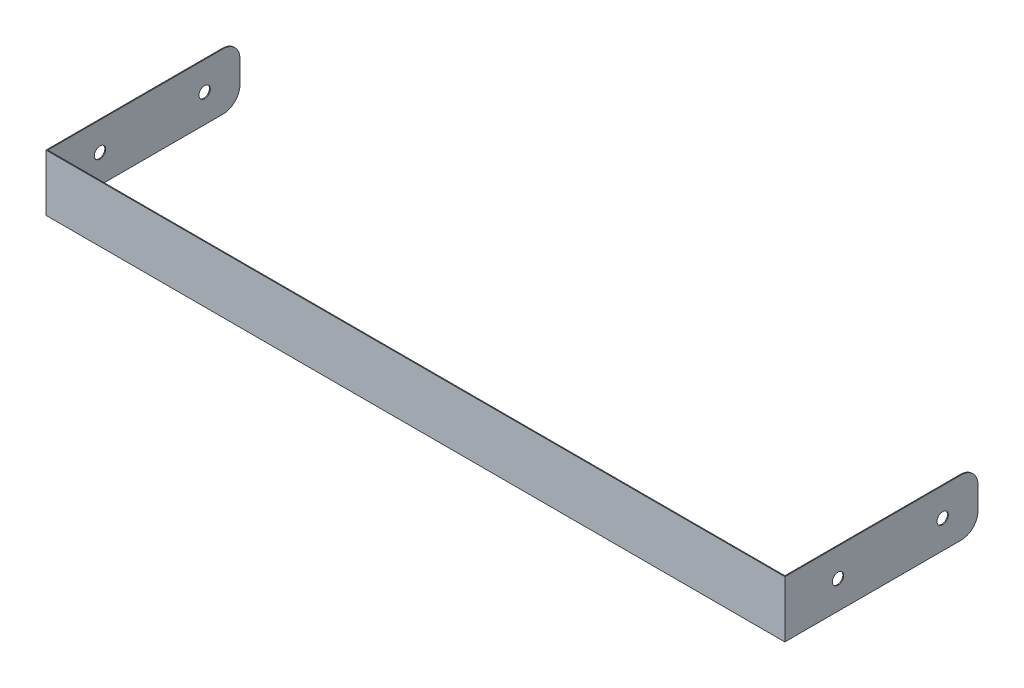
ISO-10303-21;
HEADER;
FILE_DESCRIPTION(('STEP AP214'),'2;1');
FILE_NAME('part.step','',(''),(''),'','','');
FILE_SCHEMA(('AUTOMOTIVE_DESIGN { 1 0 10303 214 1 1 1 1 }'));
ENDSEC;
DATA;
#1=APPLICATION_CONTEXT('core data for automotive mechanical design processes');
#2=APPLICATION_PROTOCOL_DEFINITION('international standard','automotive_design',2000,#1);
#3=PRODUCT_CONTEXT('',#1,'mechanical');
#4=PRODUCT('Part','Part','',(#3));
#5=PRODUCT_RELATED_PRODUCT_CATEGORY('part','',(#4));
#6=PRODUCT_DEFINITION_FORMATION('','',#4);
#7=PRODUCT_DEFINITION_CONTEXT('part definition',#1,'design');
#8=PRODUCT_DEFINITION('design','',#6,#7);
#9=PRODUCT_DEFINITION_SHAPE('','',#8);
#10=(LENGTH_UNIT() NAMED_UNIT(*) SI_UNIT(.MILLI.,.METRE.));
#11=(NAMED_UNIT(*) PLANE_ANGLE_UNIT() SI_UNIT($,.RADIAN.));
#12=(NAMED_UNIT(*) SI_UNIT($,.STERADIAN.) SOLID_ANGLE_UNIT());
#13=UNCERTAINTY_MEASURE_WITH_UNIT(LENGTH_MEASURE(1.E-05),#10,'distance_accuracy_value','');
#14=(GEOMETRIC_REPRESENTATION_CONTEXT(3) GLOBAL_UNCERTAINTY_ASSIGNED_CONTEXT((#13)) GLOBAL_UNIT_ASSIGNED_CONTEXT((#10,
#11,#12)) REPRESENTATION_CONTEXT('',''));
#15=CARTESIAN_POINT('',(0.,0.,0.));
#16=DIRECTION('',(0.,0.,1.));
#17=DIRECTION('',(1.,0.,0.));
#18=AXIS2_PLACEMENT_3D('',#15,#16,#17);
#19=CARTESIAN_POINT('',(-130.5,10.,0.));
#20=DIRECTION('',(1.,0.,0.));
#21=DIRECTION('',(0.,0.,-1.));
#22=AXIS2_PLACEMENT_3D('',#19,#20,#21);
#23=PLANE('',#22);
#24=CARTESIAN_POINT('',(-130.5,5.,6.25000000000002));
#25=DIRECTION('',(1.,0.,0.));
#26=DIRECTION('',(0.,0.,-1.));
#27=AXIS2_PLACEMENT_3D('',#24,#25,#26);
#28=CIRCLE('',#27,1.);
#29=CARTESIAN_POINT('',(-130.5,5.,5.25000000000002));
#30=VERTEX_POINT('',#29);
#31=EDGE_CURVE('E162',#30,#30,#28,.T.);
#32=ORIENTED_EDGE('',*,*,#31,.F.);
#33=EDGE_LOOP('',(#32));
#34=FACE_BOUND('',#33,.T.);
#35=CARTESIAN_POINT('',(-130.5,5.,24.75));
#36=DIRECTION('',(1.,0.,0.));
#37=DIRECTION('',(0.,0.,-1.));
#38=AXIS2_PLACEMENT_3D('',#35,#36,#37);
#39=CIRCLE('',#38,1.);
#40=CARTESIAN_POINT('',(-130.5,5.,23.75));
#41=VERTEX_POINT('',#40);
#42=EDGE_CURVE('E223',#41,#41,#39,.T.);
#43=ORIENTED_EDGE('',*,*,#42,.F.);
#44=EDGE_LOOP('',(#43));
#45=FACE_BOUND('',#44,.T.);
#46=DIRECTION('',(0.,0.,1.));
#47=VECTOR('',#46,1.);
#48=CARTESIAN_POINT('',(-130.5,0.,0.));
#49=LINE('',#48,#47);
#50=CARTESIAN_POINT('',(-130.5,0.,3.));
#51=VERTEX_POINT('',#50);
#52=CARTESIAN_POINT('',(-130.5,0.,34.));
#53=VERTEX_POINT('',#52);
#54=EDGE_CURVE('E160',#51,#53,#49,.T.);
#55=ORIENTED_EDGE('',*,*,#54,.F.);
#56=CARTESIAN_POINT('',(-130.5,3.,3.));
#57=DIRECTION('',(1.,0.,0.));
#58=DIRECTION('',(0.,0.,-1.));
#59=AXIS2_PLACEMENT_3D('',#56,#57,#58);
#60=CIRCLE('',#59,3.);
#61=CARTESIAN_POINT('',(-130.5,3.,0.));
#62=VERTEX_POINT('',#61);
#63=EDGE_CURVE('E11',#51,#62,#60,.T.);
#64=ORIENTED_EDGE('',*,*,#63,.T.);
#65=DIRECTION('',(0.,-1.,0.));
#66=VECTOR('',#65,1.);
#67=CARTESIAN_POINT('',(-130.5,10.,0.));
#68=LINE('',#67,#66);
#69=CARTESIAN_POINT('',(-130.5,7.,0.));
#70=VERTEX_POINT('',#69);
#71=EDGE_CURVE('E174',#70,#62,#68,.T.);
#72=ORIENTED_EDGE('',*,*,#71,.F.);
#73=CARTESIAN_POINT('',(-130.5,7.,3.));
#74=DIRECTION('',(1.,0.,0.));
#75=DIRECTION('',(0.,0.,-1.));
#76=AXIS2_PLACEMENT_3D('',#73,#74,#75);
#77=CIRCLE('',#76,3.);
#78=CARTESIAN_POINT('',(-130.5,10.,3.));
#79=VERTEX_POINT('',#78);
#80=EDGE_CURVE('E43',#70,#79,#77,.T.);
#81=ORIENTED_EDGE('',*,*,#80,.T.);
#82=DIRECTION('',(0.,0.,1.));
#83=VECTOR('',#82,1.);
#84=CARTESIAN_POINT('',(-130.5,10.,0.));
#85=LINE('',#84,#83);
#86=CARTESIAN_POINT('',(-130.5,10.,34.));
#87=VERTEX_POINT('',#86);
#88=EDGE_CURVE('E124',#79,#87,#85,.T.);
#89=ORIENTED_EDGE('',*,*,#88,.T.);
#90=DIRECTION('',(0.,-1.,0.));
#91=VECTOR('',#90,1.);
#92=CARTESIAN_POINT('',(-130.5,10.,34.));
#93=LINE('',#92,#91);
#94=EDGE_CURVE('E126',#87,#53,#93,.T.);
#95=ORIENTED_EDGE('',*,*,#94,.T.);
#96=EDGE_LOOP('',(#55,#64,#72,#81,#89,#95));
#97=FACE_BOUND('',#96,.T.);
#98=ADVANCED_FACE('F34',(#34,#45,#97),#23,.T.);
#99=CARTESIAN_POINT('',(-130.5,10.,0.));
#100=DIRECTION('',(1.06666736205726E-13,0.,1.));
#101=DIRECTION('',(1.,0.,-1.06666736205726E-13));
#102=AXIS2_PLACEMENT_3D('',#99,#100,#101);
#103=PLANE('',#102);
#104=ORIENTED_EDGE('',*,*,#71,.T.);
#105=DIRECTION('',(-1.,0.,1.06666736205726E-13));
#106=VECTOR('',#105,1.);
#107=CARTESIAN_POINT('',(-130.5,3.,0.));
#108=LINE('',#107,#106);
#109=CARTESIAN_POINT('',(-130.65,3.,0.));
#110=VERTEX_POINT('',#109);
#111=EDGE_CURVE('E214',#62,#110,#108,.T.);
#112=ORIENTED_EDGE('',*,*,#111,.T.);
#113=DIRECTION('',(0.,-1.,0.));
#114=VECTOR('',#113,1.);
#115=CARTESIAN_POINT('',(-130.65,10.,0.));
#116=LINE('',#115,#114);
#117=CARTESIAN_POINT('',(-130.65,7.,0.));
#118=VERTEX_POINT('',#117);
#119=EDGE_CURVE('E177',#118,#110,#116,.T.);
#120=ORIENTED_EDGE('',*,*,#119,.F.);
#121=DIRECTION('',(-1.,0.,1.06666736205726E-13));
#122=VECTOR('',#121,1.);
#123=CARTESIAN_POINT('',(-130.5,7.,0.));
#124=LINE('',#123,#122);
#125=EDGE_CURVE('E56',#118,#70,#124,.F.);
#126=ORIENTED_EDGE('',*,*,#125,.T.);
#127=EDGE_LOOP('',(#104,#112,#120,#126));
#128=FACE_BOUND('',#127,.T.);
#129=ADVANCED_FACE('F284',(#128),#103,.F.);
#130=CARTESIAN_POINT('',(-130.65,10.,34.15));
#131=DIRECTION('',(-1.,0.,0.));
#132=DIRECTION('',(0.,0.,1.));
#133=AXIS2_PLACEMENT_3D('',#130,#131,#132);
#134=PLANE('',#133);
#135=CARTESIAN_POINT('',(-130.65,5.,6.25000000000002));
#136=DIRECTION('',(-1.,0.,0.));
#137=DIRECTION('',(0.,0.,1.));
#138=AXIS2_PLACEMENT_3D('',#135,#136,#137);
#139=CIRCLE('',#138,1.);
#140=CARTESIAN_POINT('',(-130.65,5.,7.25000000000002));
#141=VERTEX_POINT('',#140);
#142=EDGE_CURVE('E224',#141,#141,#139,.F.);
#143=ORIENTED_EDGE('',*,*,#142,.T.);
#144=EDGE_LOOP('',(#143));
#145=FACE_BOUND('',#144,.T.);
#146=CARTESIAN_POINT('',(-130.65,5.,24.75));
#147=DIRECTION('',(-1.,0.,0.));
#148=DIRECTION('',(0.,0.,1.));
#149=AXIS2_PLACEMENT_3D('',#146,#147,#148);
#150=CIRCLE('',#149,1.);
#151=CARTESIAN_POINT('',(-130.65,5.,25.75));
#152=VERTEX_POINT('',#151);
#153=EDGE_CURVE('E238',#152,#152,#150,.F.);
#154=ORIENTED_EDGE('',*,*,#153,.T.);
#155=EDGE_LOOP('',(#154));
#156=FACE_BOUND('',#155,.T.);
#157=ORIENTED_EDGE('',*,*,#119,.T.);
#158=CARTESIAN_POINT('',(-130.65,3.,3.00000000000002));
#159=DIRECTION('',(-1.,0.,0.));
#160=DIRECTION('',(0.,0.,1.));
#161=AXIS2_PLACEMENT_3D('',#158,#159,#160);
#162=CIRCLE('',#161,3.);
#163=CARTESIAN_POINT('',(-130.65,0.,3.00000000000002));
#164=VERTEX_POINT('',#163);
#165=EDGE_CURVE('E219',#110,#164,#162,.T.);
#166=ORIENTED_EDGE('',*,*,#165,.T.);
#167=DIRECTION('',(0.,0.,-1.));
#168=VECTOR('',#167,1.);
#169=CARTESIAN_POINT('',(-130.65,0.,34.15));
#170=LINE('',#169,#168);
#171=CARTESIAN_POINT('',(-130.65,0.,34.15));
#172=VERTEX_POINT('',#171);
#173=EDGE_CURVE('E134',#172,#164,#170,.T.);
#174=ORIENTED_EDGE('',*,*,#173,.F.);
#175=DIRECTION('',(0.,-1.,0.));
#176=VECTOR('',#175,1.);
#177=CARTESIAN_POINT('',(-130.65,10.,34.15));
#178=LINE('',#177,#176);
#179=CARTESIAN_POINT('',(-130.65,10.,34.15));
#180=VERTEX_POINT('',#179);
#181=EDGE_CURVE('E180',#180,#172,#178,.T.);
#182=ORIENTED_EDGE('',*,*,#181,.F.);
#183=DIRECTION('',(0.,0.,-1.));
#184=VECTOR('',#183,1.);
#185=CARTESIAN_POINT('',(-130.65,10.,34.15));
#186=LINE('',#185,#184);
#187=CARTESIAN_POINT('',(-130.65,10.,3.00000000000002));
#188=VERTEX_POINT('',#187);
#189=EDGE_CURVE('E142',#180,#188,#186,.T.);
#190=ORIENTED_EDGE('',*,*,#189,.T.);
#191=CARTESIAN_POINT('',(-130.65,7.,3.00000000000002));
#192=DIRECTION('',(-1.,0.,0.));
#193=DIRECTION('',(0.,0.,1.));
#194=AXIS2_PLACEMENT_3D('',#191,#192,#193);
#195=CIRCLE('',#194,3.);
#196=EDGE_CURVE('E217',#188,#118,#195,.T.);
#197=ORIENTED_EDGE('',*,*,#196,.T.);
#198=EDGE_LOOP('',(#157,#166,#174,#182,#190,#197));
#199=FACE_BOUND('',#198,.T.);
#200=ADVANCED_FACE('F285',(#145,#156,#199),#134,.T.);
#201=CARTESIAN_POINT('',(0.,10.,34.15));
#202=DIRECTION('',(0.,0.,1.));
#203=DIRECTION('',(1.,0.,0.));
#204=AXIS2_PLACEMENT_3D('',#201,#202,#203);
#205=PLANE('',#204);
#206=DIRECTION('',(-1.,0.,0.));
#207=VECTOR('',#206,1.);
#208=CARTESIAN_POINT('',(0.,0.,34.15));
#209=LINE('',#208,#207);
#210=CARTESIAN_POINT('',(0.,0.,34.15));
#211=VERTEX_POINT('',#210);
#212=EDGE_CURVE('E169',#211,#172,#209,.T.);
#213=ORIENTED_EDGE('',*,*,#212,.F.);
#214=DIRECTION('',(0.,-1.,0.));
#215=VECTOR('',#214,1.);
#216=CARTESIAN_POINT('',(0.,10.,34.15));
#217=LINE('',#216,#215);
#218=CARTESIAN_POINT('',(0.,10.,34.15));
#219=VERTEX_POINT('',#218);
#220=EDGE_CURVE('E182',#219,#211,#217,.T.);
#221=ORIENTED_EDGE('',*,*,#220,.F.);
#222=DIRECTION('',(-1.,0.,0.));
#223=VECTOR('',#222,1.);
#224=CARTESIAN_POINT('',(0.,10.,34.15));
#225=LINE('',#224,#223);
#226=EDGE_CURVE('E155',#219,#180,#225,.T.);
#227=ORIENTED_EDGE('',*,*,#226,.T.);
#228=ORIENTED_EDGE('',*,*,#181,.T.);
#229=EDGE_LOOP('',(#213,#221,#227,#228));
#230=FACE_BOUND('',#229,.T.);
#231=ADVANCED_FACE('F277',(#230),#205,.T.);
#232=CARTESIAN_POINT('',(0.,10.,0.));
#233=DIRECTION('',(1.,0.,0.));
#234=DIRECTION('',(0.,0.,-1.));
#235=AXIS2_PLACEMENT_3D('',#232,#233,#234);
#236=PLANE('',#235);
#237=CARTESIAN_POINT('',(0.,5.,6.25));
#238=DIRECTION('',(1.,0.,0.));
#239=DIRECTION('',(0.,0.,-1.));
#240=AXIS2_PLACEMENT_3D('',#237,#238,#239);
#241=CIRCLE('',#240,1.);
#242=CARTESIAN_POINT('',(0.,5.,5.25));
#243=VERTEX_POINT('',#242);
#244=EDGE_CURVE('E230',#243,#243,#241,.T.);
#245=ORIENTED_EDGE('',*,*,#244,.F.);
#246=EDGE_LOOP('',(#245));
#247=FACE_BOUND('',#246,.T.);
#248=CARTESIAN_POINT('',(0.,5.,24.75));
#249=DIRECTION('',(1.,0.,0.));
#250=DIRECTION('',(0.,0.,-1.));
#251=AXIS2_PLACEMENT_3D('',#248,#249,#250);
#252=CIRCLE('',#251,1.);
#253=CARTESIAN_POINT('',(0.,5.,23.75));
#254=VERTEX_POINT('',#253);
#255=EDGE_CURVE('E235',#254,#254,#252,.T.);
#256=ORIENTED_EDGE('',*,*,#255,.F.);
#257=EDGE_LOOP('',(#256));
#258=FACE_BOUND('',#257,.T.);
#259=DIRECTION('',(0.,0.,1.));
#260=VECTOR('',#259,1.);
#261=CARTESIAN_POINT('',(0.,0.,0.));
#262=LINE('',#261,#260);
#263=CARTESIAN_POINT('',(0.,0.,3.));
#264=VERTEX_POINT('',#263);
#265=EDGE_CURVE('E167',#264,#211,#262,.T.);
#266=ORIENTED_EDGE('',*,*,#265,.F.);
#267=CARTESIAN_POINT('',(0.,3.,3.));
#268=DIRECTION('',(1.,0.,0.));
#269=DIRECTION('',(0.,0.,-1.));
#270=AXIS2_PLACEMENT_3D('',#267,#268,#269);
#271=CIRCLE('',#270,3.);
#272=CARTESIAN_POINT('',(0.,3.,0.));
#273=VERTEX_POINT('',#272);
#274=EDGE_CURVE('E198',#264,#273,#271,.T.);
#275=ORIENTED_EDGE('',*,*,#274,.T.);
#276=DIRECTION('',(0.,-1.,0.));
#277=VECTOR('',#276,1.);
#278=CARTESIAN_POINT('',(0.,10.,0.));
#279=LINE('',#278,#277);
#280=CARTESIAN_POINT('',(0.,7.,0.));
#281=VERTEX_POINT('',#280);
#282=EDGE_CURVE('E185',#281,#273,#279,.T.);
#283=ORIENTED_EDGE('',*,*,#282,.F.);
#284=CARTESIAN_POINT('',(0.,7.,3.));
#285=DIRECTION('',(1.,0.,0.));
#286=DIRECTION('',(0.,0.,-1.));
#287=AXIS2_PLACEMENT_3D('',#284,#285,#286);
#288=CIRCLE('',#287,3.);
#289=CARTESIAN_POINT('',(0.,10.,3.));
#290=VERTEX_POINT('',#289);
#291=EDGE_CURVE('E196',#281,#290,#288,.T.);
#292=ORIENTED_EDGE('',*,*,#291,.T.);
#293=DIRECTION('',(0.,0.,1.));
#294=VECTOR('',#293,1.);
#295=CARTESIAN_POINT('',(0.,10.,0.));
#296=LINE('',#295,#294);
#297=EDGE_CURVE('E150',#290,#219,#296,.T.);
#298=ORIENTED_EDGE('',*,*,#297,.T.);
#299=ORIENTED_EDGE('',*,*,#220,.T.);
#300=EDGE_LOOP('',(#266,#275,#283,#292,#298,#299));
#301=FACE_BOUND('',#300,.T.);
#302=ADVANCED_FACE('F271',(#247,#258,#301),#236,.T.);
#303=CARTESIAN_POINT('',(-0.15,10.,0.));
#304=DIRECTION('',(1.06421806845905E-13,0.,-1.));
#305=DIRECTION('',(-1.,0.,-1.06421806845905E-13));
#306=AXIS2_PLACEMENT_3D('',#303,#304,#305);
#307=PLANE('',#306);
#308=ORIENTED_EDGE('',*,*,#282,.T.);
#309=DIRECTION('',(1.,0.,1.06421806845905E-13));
#310=VECTOR('',#309,1.);
#311=CARTESIAN_POINT('',(-0.15,3.,0.));
#312=LINE('',#311,#310);
#313=CARTESIAN_POINT('',(-0.15,3.,0.));
#314=VERTEX_POINT('',#313);
#315=EDGE_CURVE('E203',#273,#314,#312,.F.);
#316=ORIENTED_EDGE('',*,*,#315,.T.);
#317=DIRECTION('',(0.,-1.,0.));
#318=VECTOR('',#317,1.);
#319=CARTESIAN_POINT('',(-0.15,10.,0.));
#320=LINE('',#319,#318);
#321=CARTESIAN_POINT('',(-0.15,7.,0.));
#322=VERTEX_POINT('',#321);
#323=EDGE_CURVE('E188',#322,#314,#320,.T.);
#324=ORIENTED_EDGE('',*,*,#323,.F.);
#325=DIRECTION('',(1.,0.,1.06421806845905E-13));
#326=VECTOR('',#325,1.);
#327=CARTESIAN_POINT('',(-0.15,7.,0.));
#328=LINE('',#327,#326);
#329=EDGE_CURVE('E200',#322,#281,#328,.T.);
#330=ORIENTED_EDGE('',*,*,#329,.T.);
#331=EDGE_LOOP('',(#308,#316,#324,#330));
#332=FACE_BOUND('',#331,.T.);
#333=ADVANCED_FACE('F254',(#332),#307,.T.);
#334=CARTESIAN_POINT('',(-0.150000000000007,10.,34.));
#335=DIRECTION('',(-1.,0.,0.));
#336=DIRECTION('',(0.,0.,1.));
#337=AXIS2_PLACEMENT_3D('',#334,#335,#336);
#338=PLANE('',#337);
#339=CARTESIAN_POINT('',(-0.150000000000011,5.,6.25));
#340=DIRECTION('',(-1.,0.,0.));
#341=DIRECTION('',(0.,0.,1.));
#342=AXIS2_PLACEMENT_3D('',#339,#340,#341);
#343=CIRCLE('',#342,1.);
#344=CARTESIAN_POINT('',(-0.150000000000011,5.,7.25));
#345=VERTEX_POINT('',#344);
#346=EDGE_CURVE('E38',#345,#345,#343,.T.);
#347=ORIENTED_EDGE('',*,*,#346,.F.);
#348=EDGE_LOOP('',(#347));
#349=FACE_BOUND('',#348,.T.);
#350=CARTESIAN_POINT('',(-0.150000000000011,5.,24.75));
#351=DIRECTION('',(-1.,0.,0.));
#352=DIRECTION('',(0.,0.,1.));
#353=AXIS2_PLACEMENT_3D('',#350,#351,#352);
#354=CIRCLE('',#353,1.);
#355=CARTESIAN_POINT('',(-0.150000000000011,5.,25.75));
#356=VERTEX_POINT('',#355);
#357=EDGE_CURVE('E221',#356,#356,#354,.T.);
#358=ORIENTED_EDGE('',*,*,#357,.F.);
#359=EDGE_LOOP('',(#358));
#360=FACE_BOUND('',#359,.T.);
#361=ORIENTED_EDGE('',*,*,#323,.T.);
#362=CARTESIAN_POINT('',(-0.150000000000001,3.,2.99999999999998));
#363=DIRECTION('',(-1.,0.,0.));
#364=DIRECTION('',(0.,0.,1.));
#365=AXIS2_PLACEMENT_3D('',#362,#363,#364);
#366=CIRCLE('',#365,3.);
#367=CARTESIAN_POINT('',(-0.150000000000001,0.,2.99999999999999));
#368=VERTEX_POINT('',#367);
#369=EDGE_CURVE('E207',#314,#368,#366,.T.);
#370=ORIENTED_EDGE('',*,*,#369,.T.);
#371=DIRECTION('',(0.,0.,-1.));
#372=VECTOR('',#371,1.);
#373=CARTESIAN_POINT('',(-0.150000000000007,0.,34.));
#374=LINE('',#373,#372);
#375=CARTESIAN_POINT('',(-0.150000000000007,0.,34.));
#376=VERTEX_POINT('',#375);
#377=EDGE_CURVE('E164',#376,#368,#374,.T.);
#378=ORIENTED_EDGE('',*,*,#377,.F.);
#379=DIRECTION('',(0.,-1.,0.));
#380=VECTOR('',#379,1.);
#381=CARTESIAN_POINT('',(-0.150000000000007,10.,34.));
#382=LINE('',#381,#380);
#383=CARTESIAN_POINT('',(-0.150000000000007,10.,34.));
#384=VERTEX_POINT('',#383);
#385=EDGE_CURVE('E141',#384,#376,#382,.T.);
#386=ORIENTED_EDGE('',*,*,#385,.F.);
#387=DIRECTION('',(0.,0.,-1.));
#388=VECTOR('',#387,1.);
#389=CARTESIAN_POINT('',(-0.150000000000007,10.,34.));
#390=LINE('',#389,#388);
#391=CARTESIAN_POINT('',(-0.150000000000001,10.,2.99999999999999));
#392=VERTEX_POINT('',#391);
#393=EDGE_CURVE('E148',#384,#392,#390,.T.);
#394=ORIENTED_EDGE('',*,*,#393,.T.);
#395=CARTESIAN_POINT('',(-0.150000000000001,7.,2.99999999999998));
#396=DIRECTION('',(-1.,0.,0.));
#397=DIRECTION('',(0.,0.,1.));
#398=AXIS2_PLACEMENT_3D('',#395,#396,#397);
#399=CIRCLE('',#398,3.);
#400=EDGE_CURVE('E205',#392,#322,#399,.T.);
#401=ORIENTED_EDGE('',*,*,#400,.T.);
#402=EDGE_LOOP('',(#361,#370,#378,#386,#394,#401));
#403=FACE_BOUND('',#402,.T.);
#404=ADVANCED_FACE('F251',(#349,#360,#403),#338,.T.);
#405=CARTESIAN_POINT('',(-130.5,10.,34.));
#406=DIRECTION('',(0.,0.,-1.));
#407=DIRECTION('',(-1.,0.,0.));
#408=AXIS2_PLACEMENT_3D('',#405,#406,#407);
#409=PLANE('',#408);
#410=DIRECTION('',(1.,0.,0.));
#411=VECTOR('',#410,1.);
#412=CARTESIAN_POINT('',(-130.5,0.,34.));
#413=LINE('',#412,#411);
#414=EDGE_CURVE('E140',#53,#376,#413,.T.);
#415=ORIENTED_EDGE('',*,*,#414,.F.);
#416=ORIENTED_EDGE('',*,*,#94,.F.);
#417=DIRECTION('',(1.,0.,0.));
#418=VECTOR('',#417,1.);
#419=CARTESIAN_POINT('',(-130.5,10.,34.));
#420=LINE('',#419,#418);
#421=EDGE_CURVE('E133',#87,#384,#420,.T.);
#422=ORIENTED_EDGE('',*,*,#421,.T.);
#423=ORIENTED_EDGE('',*,*,#385,.T.);
#424=EDGE_LOOP('',(#415,#416,#422,#423));
#425=FACE_BOUND('',#424,.T.);
#426=ADVANCED_FACE('F138',(#425),#409,.T.);
#427=CARTESIAN_POINT('',(0.,10.,0.));
#428=DIRECTION('',(0.,1.,0.));
#429=DIRECTION('',(0.,0.,1.));
#430=AXIS2_PLACEMENT_3D('',#427,#428,#429);
#431=PLANE('',#430);
#432=ORIENTED_EDGE('',*,*,#297,.F.);
#433=DIRECTION('',(1.,0.,1.06421806845905E-13));
#434=VECTOR('',#433,1.);
#435=CARTESIAN_POINT('',(-3.19265420537715E-13,10.,3.));
#436=LINE('',#435,#434);
#437=EDGE_CURVE('E211',#290,#392,#436,.F.);
#438=ORIENTED_EDGE('',*,*,#437,.T.);
#439=ORIENTED_EDGE('',*,*,#393,.F.);
#440=ORIENTED_EDGE('',*,*,#421,.F.);
#441=ORIENTED_EDGE('',*,*,#88,.F.);
#442=DIRECTION('',(-1.,0.,1.06666736205726E-13));
#443=VECTOR('',#442,1.);
#444=CARTESIAN_POINT('',(-130.65,10.,3.00000000000002));
#445=LINE('',#444,#443);
#446=EDGE_CURVE('E209',#79,#188,#445,.T.);
#447=ORIENTED_EDGE('',*,*,#446,.T.);
#448=ORIENTED_EDGE('',*,*,#189,.F.);
#449=ORIENTED_EDGE('',*,*,#226,.F.);
#450=EDGE_LOOP('',(#432,#438,#439,#440,#441,#447,#448,#449));
#451=FACE_BOUND('',#450,.T.);
#452=ADVANCED_FACE('F146',(#451),#431,.T.);
#453=CARTESIAN_POINT('',(0.,0.,0.));
#454=DIRECTION('',(0.,1.,0.));
#455=DIRECTION('',(0.,0.,1.));
#456=AXIS2_PLACEMENT_3D('',#453,#454,#455);
#457=PLANE('',#456);
#458=ORIENTED_EDGE('',*,*,#377,.T.);
#459=DIRECTION('',(1.,0.,1.06421806845905E-13));
#460=VECTOR('',#459,1.);
#461=CARTESIAN_POINT('',(-3.19265420537715E-13,0.,3.));
#462=LINE('',#461,#460);
#463=EDGE_CURVE('E193',#368,#264,#462,.T.);
#464=ORIENTED_EDGE('',*,*,#463,.T.);
#465=ORIENTED_EDGE('',*,*,#265,.T.);
#466=ORIENTED_EDGE('',*,*,#212,.T.);
#467=ORIENTED_EDGE('',*,*,#173,.T.);
#468=DIRECTION('',(-1.,0.,1.06666736205726E-13));
#469=VECTOR('',#468,1.);
#470=CARTESIAN_POINT('',(3.20000208615695E-13,0.,2.99999999998608));
#471=LINE('',#470,#469);
#472=EDGE_CURVE('E176',#164,#51,#471,.F.);
#473=ORIENTED_EDGE('',*,*,#472,.T.);
#474=ORIENTED_EDGE('',*,*,#54,.T.);
#475=ORIENTED_EDGE('',*,*,#414,.T.);
#476=EDGE_LOOP('',(#458,#464,#465,#466,#467,#473,#474,#475));
#477=FACE_BOUND('',#476,.T.);
#478=ADVANCED_FACE('F269',(#477),#457,.F.);
#479=CARTESIAN_POINT('',(-3.19265420537715E-13,3.,3.));
#480=DIRECTION('',(-1.,0.,-1.06421806845905E-13));
#481=DIRECTION('',(-1.06421806845905E-13,0.,1.));
#482=AXIS2_PLACEMENT_3D('',#479,#480,#481);
#483=CYLINDRICAL_SURFACE('',#482,3.);
#484=ORIENTED_EDGE('',*,*,#369,.F.);
#485=ORIENTED_EDGE('',*,*,#315,.F.);
#486=ORIENTED_EDGE('',*,*,#274,.F.);
#487=ORIENTED_EDGE('',*,*,#463,.F.);
#488=EDGE_LOOP('',(#484,#485,#486,#487));
#489=FACE_BOUND('',#488,.T.);
#490=ADVANCED_FACE('F266',(#489),#483,.T.);
#491=CARTESIAN_POINT('',(-0.150000000000319,7.,2.99999999999998));
#492=DIRECTION('',(1.,0.,1.06421806845905E-13));
#493=DIRECTION('',(1.06421806845905E-13,0.,-1.));
#494=AXIS2_PLACEMENT_3D('',#491,#492,#493);
#495=CYLINDRICAL_SURFACE('',#494,3.);
#496=ORIENTED_EDGE('',*,*,#400,.F.);
#497=ORIENTED_EDGE('',*,*,#437,.F.);
#498=ORIENTED_EDGE('',*,*,#291,.F.);
#499=ORIENTED_EDGE('',*,*,#329,.F.);
#500=EDGE_LOOP('',(#496,#497,#498,#499));
#501=FACE_BOUND('',#500,.T.);
#502=ADVANCED_FACE('F290',(#501),#495,.T.);
#503=CARTESIAN_POINT('',(-130.5,3.,3.));
#504=DIRECTION('',(-1.,0.,1.06666736205726E-13));
#505=DIRECTION('',(1.06666736205726E-13,0.,1.));
#506=AXIS2_PLACEMENT_3D('',#503,#504,#505);
#507=CYLINDRICAL_SURFACE('',#506,3.);
#508=ORIENTED_EDGE('',*,*,#63,.F.);
#509=ORIENTED_EDGE('',*,*,#472,.F.);
#510=ORIENTED_EDGE('',*,*,#165,.F.);
#511=ORIENTED_EDGE('',*,*,#111,.F.);
#512=EDGE_LOOP('',(#508,#509,#510,#511));
#513=FACE_BOUND('',#512,.T.);
#514=ADVANCED_FACE('F282',(#513),#507,.T.);
#515=CARTESIAN_POINT('',(3.20000208615695E-13,7.,2.99999999998608));
#516=DIRECTION('',(1.,0.,-1.06666736205726E-13));
#517=DIRECTION('',(-1.06666736205726E-13,0.,-1.));
#518=AXIS2_PLACEMENT_3D('',#515,#516,#517);
#519=CYLINDRICAL_SURFACE('',#518,3.);
#520=ORIENTED_EDGE('',*,*,#80,.F.);
#521=ORIENTED_EDGE('',*,*,#125,.F.);
#522=ORIENTED_EDGE('',*,*,#196,.F.);
#523=ORIENTED_EDGE('',*,*,#446,.F.);
#524=EDGE_LOOP('',(#520,#521,#522,#523));
#525=FACE_BOUND('',#524,.T.);
#526=ADVANCED_FACE('F36',(#525),#519,.T.);
#527=CARTESIAN_POINT('',(-133.478427124746,5.,24.75));
#528=DIRECTION('',(1.,0.,0.));
#529=DIRECTION('',(0.,0.,-1.));
#530=AXIS2_PLACEMENT_3D('',#527,#528,#529);
#531=CYLINDRICAL_SURFACE('',#530,1.);
#532=ORIENTED_EDGE('',*,*,#357,.T.);
#533=EDGE_LOOP('',(#532));
#534=FACE_BOUND('',#533,.T.);
#535=ORIENTED_EDGE('',*,*,#255,.T.);
#536=EDGE_LOOP('',(#535));
#537=FACE_BOUND('',#536,.T.);
#538=ADVANCED_FACE('F315',(#534,#537),#531,.F.);
#539=CARTESIAN_POINT('',(-133.478427124746,5.,6.25000000000002));
#540=DIRECTION('',(1.,0.,0.));
#541=DIRECTION('',(0.,0.,-1.));
#542=AXIS2_PLACEMENT_3D('',#539,#540,#541);
#543=CYLINDRICAL_SURFACE('',#542,1.);
#544=ORIENTED_EDGE('',*,*,#346,.T.);
#545=EDGE_LOOP('',(#544));
#546=FACE_BOUND('',#545,.T.);
#547=ORIENTED_EDGE('',*,*,#244,.T.);
#548=EDGE_LOOP('',(#547));
#549=FACE_BOUND('',#548,.T.);
#550=ADVANCED_FACE('F248',(#546,#549),#543,.F.);
#551=ORIENTED_EDGE('',*,*,#42,.T.);
#552=EDGE_LOOP('',(#551));
#553=FACE_BOUND('',#552,.T.);
#554=ORIENTED_EDGE('',*,*,#153,.F.);
#555=EDGE_LOOP('',(#554));
#556=FACE_BOUND('',#555,.T.);
#557=ADVANCED_FACE('F320',(#553,#556),#531,.F.);
#558=ORIENTED_EDGE('',*,*,#31,.T.);
#559=EDGE_LOOP('',(#558));
#560=FACE_BOUND('',#559,.T.);
#561=ORIENTED_EDGE('',*,*,#142,.F.);
#562=EDGE_LOOP('',(#561));
#563=FACE_BOUND('',#562,.T.);
#564=ADVANCED_FACE('F325',(#560,#563),#543,.F.);
#565=CLOSED_SHELL('',(#98,#129,#200,#231,#302,#333,#404,#426,#452,#478,#490,#502,#514,#526,#538,
#550,#557,#564));
#566=MANIFOLD_SOLID_BREP('B2',#565);
#567=ADVANCED_BREP_SHAPE_REPRESENTATION('',(#18,#566),#14);
#568=SHAPE_DEFINITION_REPRESENTATION(#9,#567);
ENDSEC;
END-ISO-10303-21;
